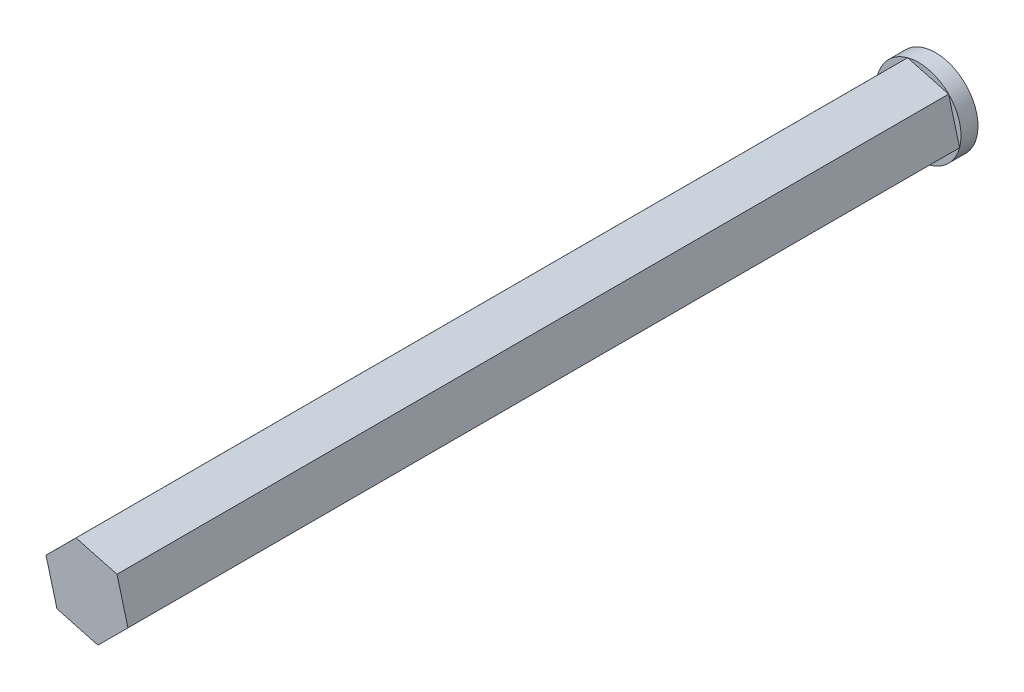
ISO-10303-21;
HEADER;
FILE_DESCRIPTION(('STEP AP214'),'2;1');
FILE_NAME('part.step','',(''),(''),'','','');
FILE_SCHEMA(('AUTOMOTIVE_DESIGN { 1 0 10303 214 1 1 1 1 }'));
ENDSEC;
DATA;
#1=APPLICATION_CONTEXT('core data for automotive mechanical design processes');
#2=APPLICATION_PROTOCOL_DEFINITION('international standard','automotive_design',2000,#1);
#3=PRODUCT_CONTEXT('',#1,'mechanical');
#4=PRODUCT('Part','Part','',(#3));
#5=PRODUCT_RELATED_PRODUCT_CATEGORY('part','',(#4));
#6=PRODUCT_DEFINITION_FORMATION('','',#4);
#7=PRODUCT_DEFINITION_CONTEXT('part definition',#1,'design');
#8=PRODUCT_DEFINITION('design','',#6,#7);
#9=PRODUCT_DEFINITION_SHAPE('','',#8);
#10=(LENGTH_UNIT() NAMED_UNIT(*) SI_UNIT(.MILLI.,.METRE.));
#11=(NAMED_UNIT(*) PLANE_ANGLE_UNIT() SI_UNIT($,.RADIAN.));
#12=(NAMED_UNIT(*) SI_UNIT($,.STERADIAN.) SOLID_ANGLE_UNIT());
#13=UNCERTAINTY_MEASURE_WITH_UNIT(LENGTH_MEASURE(1.E-05),#10,'distance_accuracy_value','');
#14=(GEOMETRIC_REPRESENTATION_CONTEXT(3) GLOBAL_UNCERTAINTY_ASSIGNED_CONTEXT((#13)) GLOBAL_UNIT_ASSIGNED_CONTEXT((#10,
#11,#12)) REPRESENTATION_CONTEXT('',''));
#15=CARTESIAN_POINT('',(0.,0.,0.));
#16=DIRECTION('',(0.,0.,1.));
#17=DIRECTION('',(1.,0.,0.));
#18=AXIS2_PLACEMENT_3D('',#15,#16,#17);
#19=CARTESIAN_POINT('',(-3.46570193380558,4.47730394193968,1.));
#20=DIRECTION('',(0.,0.,1.));
#21=DIRECTION('',(1.,0.,0.));
#22=AXIS2_PLACEMENT_3D('',#19,#20,#21);
#23=PLANE('',#22);
#24=DIRECTION('',(0.707519640490807,0.70669368068475,0.));
#25=VECTOR('',#24,1.);
#26=CARTESIAN_POINT('',(-2.82006478400178,2.06211188523006,1.));
#27=LINE('',#26,#25);
#28=CARTESIAN_POINT('',(-2.82006478400178,2.06211188523006,1.));
#29=VERTEX_POINT('',#28);
#30=CARTESIAN_POINT('',(-1.05126568277476,3.82884608694194,1.));
#31=VERTEX_POINT('',#30);
#32=EDGE_CURVE('E56',#29,#31,#27,.T.);
#33=ORIENTED_EDGE('',*,*,#32,.F.);
#34=CARTESIAN_POINT('',(-3.46570193380558,4.47730394193968,1.));
#35=DIRECTION('',(0.,0.,1.));
#36=DIRECTION('',(1.,0.,0.));
#37=AXIS2_PLACEMENT_3D('',#34,#35,#36);
#38=CIRCLE('',#37,2.5);
#39=EDGE_CURVE('E171',#29,#31,#38,.T.);
#40=ORIENTED_EDGE('',*,*,#39,.T.);
#41=EDGE_LOOP('',(#33,#40));
#42=FACE_BOUND('',#41,.T.);
#43=ADVANCED_FACE('F33',(#42),#23,.T.);
#44=DIRECTION('',(0.965774500412325,-0.259383141999097,0.));
#45=VECTOR('',#44,1.);
#46=CARTESIAN_POINT('',(-5.23450103503259,2.71056974022781,1.));
#47=LINE('',#46,#45);
#48=CARTESIAN_POINT('',(-5.23450103503259,2.71056974022781,1.));
#49=VERTEX_POINT('',#48);
#50=EDGE_CURVE('E109',#49,#29,#47,.T.);
#51=ORIENTED_EDGE('',*,*,#50,.F.);
#52=EDGE_CURVE('E163',#49,#29,#38,.T.);
#53=ORIENTED_EDGE('',*,*,#52,.T.);
#54=EDGE_LOOP('',(#51,#53));
#55=FACE_BOUND('',#54,.T.);
#56=ADVANCED_FACE('F162',(#55),#23,.T.);
#57=DIRECTION('',(0.258254859921518,-0.966076822683847,0.));
#58=VECTOR('',#57,1.);
#59=CARTESIAN_POINT('',(-5.88013818483639,5.12576179693742,1.));
#60=LINE('',#59,#58);
#61=CARTESIAN_POINT('',(-5.88013818483639,5.12576179693742,1.));
#62=VERTEX_POINT('',#61);
#63=EDGE_CURVE('E129',#62,#49,#60,.T.);
#64=ORIENTED_EDGE('',*,*,#63,.F.);
#65=EDGE_CURVE('E169',#62,#49,#38,.T.);
#66=ORIENTED_EDGE('',*,*,#65,.T.);
#67=EDGE_LOOP('',(#64,#66));
#68=FACE_BOUND('',#67,.T.);
#69=ADVANCED_FACE('F173',(#68),#23,.T.);
#70=DIRECTION('',(-0.707519640490807,-0.70669368068475,0.));
#71=VECTOR('',#70,1.);
#72=CARTESIAN_POINT('',(-4.11133908360937,6.8924959986493,1.));
#73=LINE('',#72,#71);
#74=CARTESIAN_POINT('',(-4.11133908360937,6.8924959986493,1.));
#75=VERTEX_POINT('',#74);
#76=EDGE_CURVE('E132',#75,#62,#73,.T.);
#77=ORIENTED_EDGE('',*,*,#76,.F.);
#78=EDGE_CURVE('E42',#75,#62,#38,.T.);
#79=ORIENTED_EDGE('',*,*,#78,.T.);
#80=EDGE_LOOP('',(#77,#79));
#81=FACE_BOUND('',#80,.T.);
#82=ADVANCED_FACE('F175',(#81),#23,.T.);
#83=DIRECTION('',(-0.965774500412325,0.259383141999097,0.));
#84=VECTOR('',#83,1.);
#85=CARTESIAN_POINT('',(-1.69690283257856,6.24403814365156,1.));
#86=LINE('',#85,#84);
#87=CARTESIAN_POINT('',(-1.69690283257856,6.24403814365156,1.));
#88=VERTEX_POINT('',#87);
#89=EDGE_CURVE('E135',#88,#75,#86,.T.);
#90=ORIENTED_EDGE('',*,*,#89,.F.);
#91=EDGE_CURVE('E11',#88,#75,#38,.T.);
#92=ORIENTED_EDGE('',*,*,#91,.T.);
#93=EDGE_LOOP('',(#90,#92));
#94=FACE_BOUND('',#93,.T.);
#95=ADVANCED_FACE('F177',(#94),#23,.T.);
#96=CARTESIAN_POINT('',(-3.46570193380558,4.47730394193968,1.));
#97=DIRECTION('',(0.,0.,-1.));
#98=DIRECTION('',(-1.,0.,0.));
#99=AXIS2_PLACEMENT_3D('',#96,#97,#98);
#100=CYLINDRICAL_SURFACE('',#99,2.5);
#101=ORIENTED_EDGE('',*,*,#91,.F.);
#102=EDGE_CURVE('E43',#31,#88,#38,.T.);
#103=ORIENTED_EDGE('',*,*,#102,.F.);
#104=ORIENTED_EDGE('',*,*,#39,.F.);
#105=ORIENTED_EDGE('',*,*,#52,.F.);
#106=ORIENTED_EDGE('',*,*,#65,.F.);
#107=ORIENTED_EDGE('',*,*,#78,.F.);
#108=EDGE_LOOP('',(#101,#103,#104,#105,#106,#107));
#109=FACE_BOUND('',#108,.T.);
#110=CARTESIAN_POINT('',(-3.46570193380558,4.47730394193968,0.));
#111=DIRECTION('',(0.,0.,1.));
#112=DIRECTION('',(1.,0.,0.));
#113=AXIS2_PLACEMENT_3D('',#110,#111,#112);
#114=CIRCLE('',#113,2.5);
#115=CARTESIAN_POINT('',(-0.965701933805576,4.47730394193968,0.));
#116=VERTEX_POINT('',#115);
#117=EDGE_CURVE('E37',#116,#116,#114,.T.);
#118=ORIENTED_EDGE('',*,*,#117,.T.);
#119=EDGE_LOOP('',(#118));
#120=FACE_BOUND('',#119,.T.);
#121=ADVANCED_FACE('F35',(#109,#120),#100,.T.);
#122=DIRECTION('',(-0.258254859921518,0.966076822683847,0.));
#123=VECTOR('',#122,1.);
#124=CARTESIAN_POINT('',(-1.05126568277476,3.82884608694194,1.));
#125=LINE('',#124,#123);
#126=EDGE_CURVE('E49',#31,#88,#125,.T.);
#127=ORIENTED_EDGE('',*,*,#126,.F.);
#128=ORIENTED_EDGE('',*,*,#102,.T.);
#129=EDGE_LOOP('',(#127,#128));
#130=FACE_BOUND('',#129,.T.);
#131=ADVANCED_FACE('F180',(#130),#23,.T.);
#132=CARTESIAN_POINT('',(-3.46570193380558,4.47730394193968,0.));
#133=DIRECTION('',(0.,0.,1.));
#134=DIRECTION('',(1.,0.,0.));
#135=AXIS2_PLACEMENT_3D('',#132,#133,#134);
#136=PLANE('',#135);
#137=ORIENTED_EDGE('',*,*,#117,.F.);
#138=EDGE_LOOP('',(#137));
#139=FACE_BOUND('',#138,.T.);
#140=ADVANCED_FACE('F187',(#139),#136,.F.);
#141=CARTESIAN_POINT('',(-2.82006478400178,2.06211188523006,50.));
#142=DIRECTION('',(-0.70669368068475,0.707519640490807,0.));
#143=DIRECTION('',(-0.707519640490807,-0.70669368068475,0.));
#144=AXIS2_PLACEMENT_3D('',#141,#142,#143);
#145=PLANE('',#144);
#146=ORIENTED_EDGE('',*,*,#32,.T.);
#147=DIRECTION('',(0.,0.,-1.));
#148=VECTOR('',#147,1.);
#149=CARTESIAN_POINT('',(-1.05126568277476,3.82884608694194,50.));
#150=LINE('',#149,#148);
#151=CARTESIAN_POINT('',(-1.05126568277476,3.82884608694194,50.));
#152=VERTEX_POINT('',#151);
#153=EDGE_CURVE('E94',#152,#31,#150,.T.);
#154=ORIENTED_EDGE('',*,*,#153,.F.);
#155=DIRECTION('',(0.707519640490807,0.70669368068475,0.));
#156=VECTOR('',#155,1.);
#157=CARTESIAN_POINT('',(-2.82006478400178,2.06211188523006,50.));
#158=LINE('',#157,#156);
#159=CARTESIAN_POINT('',(-2.82006478400178,2.06211188523006,50.));
#160=VERTEX_POINT('',#159);
#161=EDGE_CURVE('E100',#160,#152,#158,.T.);
#162=ORIENTED_EDGE('',*,*,#161,.F.);
#163=DIRECTION('',(0.,0.,-1.));
#164=VECTOR('',#163,1.);
#165=CARTESIAN_POINT('',(-2.82006478400178,2.06211188523006,50.));
#166=LINE('',#165,#164);
#167=EDGE_CURVE('E125',#160,#29,#166,.T.);
#168=ORIENTED_EDGE('',*,*,#167,.T.);
#169=EDGE_LOOP('',(#146,#154,#162,#168));
#170=FACE_BOUND('',#169,.T.);
#171=ADVANCED_FACE('F111',(#170),#145,.F.);
#172=CARTESIAN_POINT('',(-1.05126568277476,3.82884608694194,50.));
#173=DIRECTION('',(-0.966076822683847,-0.258254859921518,0.));
#174=DIRECTION('',(0.258254859921518,-0.966076822683847,0.));
#175=AXIS2_PLACEMENT_3D('',#172,#173,#174);
#176=PLANE('',#175);
#177=ORIENTED_EDGE('',*,*,#126,.T.);
#178=DIRECTION('',(0.,0.,-1.));
#179=VECTOR('',#178,1.);
#180=CARTESIAN_POINT('',(-1.69690283257856,6.24403814365156,50.));
#181=LINE('',#180,#179);
#182=CARTESIAN_POINT('',(-1.69690283257856,6.24403814365156,50.));
#183=VERTEX_POINT('',#182);
#184=EDGE_CURVE('E96',#183,#88,#181,.T.);
#185=ORIENTED_EDGE('',*,*,#184,.F.);
#186=DIRECTION('',(-0.258254859921518,0.966076822683847,0.));
#187=VECTOR('',#186,1.);
#188=CARTESIAN_POINT('',(-1.05126568277476,3.82884608694194,50.));
#189=LINE('',#188,#187);
#190=EDGE_CURVE('E90',#152,#183,#189,.T.);
#191=ORIENTED_EDGE('',*,*,#190,.F.);
#192=ORIENTED_EDGE('',*,*,#153,.T.);
#193=EDGE_LOOP('',(#177,#185,#191,#192));
#194=FACE_BOUND('',#193,.T.);
#195=ADVANCED_FACE('F92',(#194),#176,.F.);
#196=CARTESIAN_POINT('',(-1.69690283257856,6.24403814365156,50.));
#197=DIRECTION('',(-0.259383141999097,-0.965774500412325,0.));
#198=DIRECTION('',(0.965774500412325,-0.259383141999097,0.));
#199=AXIS2_PLACEMENT_3D('',#196,#197,#198);
#200=PLANE('',#199);
#201=ORIENTED_EDGE('',*,*,#89,.T.);
#202=DIRECTION('',(0.,0.,-1.));
#203=VECTOR('',#202,1.);
#204=CARTESIAN_POINT('',(-4.11133908360937,6.8924959986493,50.));
#205=LINE('',#204,#203);
#206=CARTESIAN_POINT('',(-4.11133908360937,6.8924959986493,50.));
#207=VERTEX_POINT('',#206);
#208=EDGE_CURVE('E114',#207,#75,#205,.T.);
#209=ORIENTED_EDGE('',*,*,#208,.F.);
#210=DIRECTION('',(-0.965774500412325,0.259383141999097,0.));
#211=VECTOR('',#210,1.);
#212=CARTESIAN_POINT('',(-1.69690283257856,6.24403814365156,50.));
#213=LINE('',#212,#211);
#214=EDGE_CURVE('E99',#183,#207,#213,.T.);
#215=ORIENTED_EDGE('',*,*,#214,.F.);
#216=ORIENTED_EDGE('',*,*,#184,.T.);
#217=EDGE_LOOP('',(#201,#209,#215,#216));
#218=FACE_BOUND('',#217,.T.);
#219=ADVANCED_FACE('F149',(#218),#200,.F.);
#220=CARTESIAN_POINT('',(-4.11133908360937,6.8924959986493,50.));
#221=DIRECTION('',(0.70669368068475,-0.707519640490807,0.));
#222=DIRECTION('',(0.707519640490807,0.70669368068475,0.));
#223=AXIS2_PLACEMENT_3D('',#220,#221,#222);
#224=PLANE('',#223);
#225=ORIENTED_EDGE('',*,*,#76,.T.);
#226=DIRECTION('',(0.,0.,-1.));
#227=VECTOR('',#226,1.);
#228=CARTESIAN_POINT('',(-5.88013818483639,5.12576179693742,50.));
#229=LINE('',#228,#227);
#230=CARTESIAN_POINT('',(-5.88013818483639,5.12576179693742,50.));
#231=VERTEX_POINT('',#230);
#232=EDGE_CURVE('E119',#231,#62,#229,.T.);
#233=ORIENTED_EDGE('',*,*,#232,.F.);
#234=DIRECTION('',(-0.707519640490807,-0.70669368068475,0.));
#235=VECTOR('',#234,1.);
#236=CARTESIAN_POINT('',(-4.11133908360937,6.8924959986493,50.));
#237=LINE('',#236,#235);
#238=EDGE_CURVE('E143',#207,#231,#237,.T.);
#239=ORIENTED_EDGE('',*,*,#238,.F.);
#240=ORIENTED_EDGE('',*,*,#208,.T.);
#241=EDGE_LOOP('',(#225,#233,#239,#240));
#242=FACE_BOUND('',#241,.T.);
#243=ADVANCED_FACE('F152',(#242),#224,.F.);
#244=CARTESIAN_POINT('',(-5.88013818483639,5.12576179693742,50.));
#245=DIRECTION('',(0.966076822683847,0.258254859921518,0.));
#246=DIRECTION('',(-0.258254859921518,0.966076822683847,0.));
#247=AXIS2_PLACEMENT_3D('',#244,#245,#246);
#248=PLANE('',#247);
#249=ORIENTED_EDGE('',*,*,#63,.T.);
#250=DIRECTION('',(0.,0.,-1.));
#251=VECTOR('',#250,1.);
#252=CARTESIAN_POINT('',(-5.23450103503259,2.71056974022781,50.));
#253=LINE('',#252,#251);
#254=CARTESIAN_POINT('',(-5.23450103503259,2.71056974022781,50.));
#255=VERTEX_POINT('',#254);
#256=EDGE_CURVE('E122',#255,#49,#253,.T.);
#257=ORIENTED_EDGE('',*,*,#256,.F.);
#258=DIRECTION('',(0.258254859921518,-0.966076822683847,0.));
#259=VECTOR('',#258,1.);
#260=CARTESIAN_POINT('',(-5.88013818483639,5.12576179693742,50.));
#261=LINE('',#260,#259);
#262=EDGE_CURVE('E141',#231,#255,#261,.T.);
#263=ORIENTED_EDGE('',*,*,#262,.F.);
#264=ORIENTED_EDGE('',*,*,#232,.T.);
#265=EDGE_LOOP('',(#249,#257,#263,#264));
#266=FACE_BOUND('',#265,.T.);
#267=ADVANCED_FACE('F156',(#266),#248,.F.);
#268=CARTESIAN_POINT('',(-5.23450103503259,2.71056974022781,50.));
#269=DIRECTION('',(0.259383141999097,0.965774500412325,0.));
#270=DIRECTION('',(-0.965774500412325,0.259383141999097,0.));
#271=AXIS2_PLACEMENT_3D('',#268,#269,#270);
#272=PLANE('',#271);
#273=ORIENTED_EDGE('',*,*,#50,.T.);
#274=ORIENTED_EDGE('',*,*,#167,.F.);
#275=DIRECTION('',(0.965774500412325,-0.259383141999097,0.));
#276=VECTOR('',#275,1.);
#277=CARTESIAN_POINT('',(-5.23450103503259,2.71056974022781,50.));
#278=LINE('',#277,#276);
#279=EDGE_CURVE('E105',#255,#160,#278,.T.);
#280=ORIENTED_EDGE('',*,*,#279,.F.);
#281=ORIENTED_EDGE('',*,*,#256,.T.);
#282=EDGE_LOOP('',(#273,#274,#280,#281));
#283=FACE_BOUND('',#282,.T.);
#284=ADVANCED_FACE('F158',(#283),#272,.F.);
#285=CARTESIAN_POINT('',(0.,0.,50.));
#286=DIRECTION('',(0.,0.,1.));
#287=DIRECTION('',(1.,0.,0.));
#288=AXIS2_PLACEMENT_3D('',#285,#286,#287);
#289=PLANE('',#288);
#290=ORIENTED_EDGE('',*,*,#161,.T.);
#291=ORIENTED_EDGE('',*,*,#190,.T.);
#292=ORIENTED_EDGE('',*,*,#214,.T.);
#293=ORIENTED_EDGE('',*,*,#238,.T.);
#294=ORIENTED_EDGE('',*,*,#262,.T.);
#295=ORIENTED_EDGE('',*,*,#279,.T.);
#296=EDGE_LOOP('',(#290,#291,#292,#293,#294,#295));
#297=FACE_BOUND('',#296,.T.);
#298=ADVANCED_FACE('F103',(#297),#289,.T.);
#299=CLOSED_SHELL('',(#43,#56,#69,#82,#95,#121,#131,#140,#171,#195,#219,#243,#267,#284,#298));
#300=MANIFOLD_SOLID_BREP('B2',#299);
#301=ADVANCED_BREP_SHAPE_REPRESENTATION('',(#18,#300),#14);
#302=SHAPE_DEFINITION_REPRESENTATION(#9,#301);
ENDSEC;
END-ISO-10303-21;
